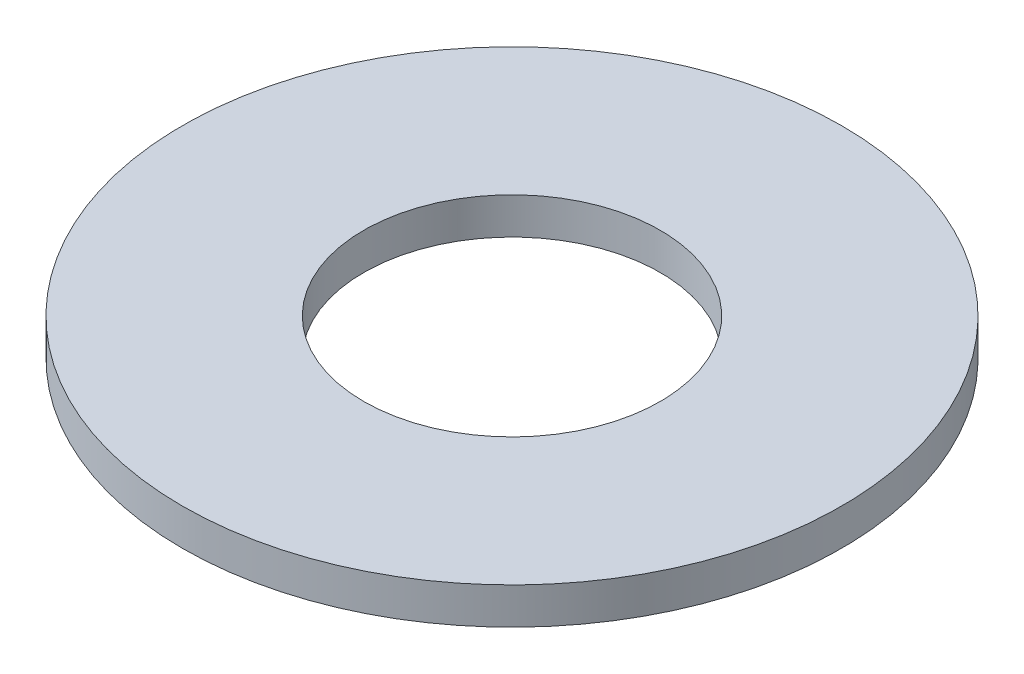
ISO-10303-21;
HEADER;
FILE_DESCRIPTION(('STEP AP214'),'2;1');
FILE_NAME('part.step','',(''),(''),'','','');
FILE_SCHEMA(('AUTOMOTIVE_DESIGN { 1 0 10303 214 1 1 1 1 }'));
ENDSEC;
DATA;
#1=APPLICATION_CONTEXT('core data for automotive mechanical design processes');
#2=APPLICATION_PROTOCOL_DEFINITION('international standard','automotive_design',2000,#1);
#3=PRODUCT_CONTEXT('',#1,'mechanical');
#4=PRODUCT('Part','Part','',(#3));
#5=PRODUCT_RELATED_PRODUCT_CATEGORY('part','',(#4));
#6=PRODUCT_DEFINITION_FORMATION('','',#4);
#7=PRODUCT_DEFINITION_CONTEXT('part definition',#1,'design');
#8=PRODUCT_DEFINITION('design','',#6,#7);
#9=PRODUCT_DEFINITION_SHAPE('','',#8);
#10=(LENGTH_UNIT() NAMED_UNIT(*) SI_UNIT(.MILLI.,.METRE.));
#11=(NAMED_UNIT(*) PLANE_ANGLE_UNIT() SI_UNIT($,.RADIAN.));
#12=(NAMED_UNIT(*) SI_UNIT($,.STERADIAN.) SOLID_ANGLE_UNIT());
#13=UNCERTAINTY_MEASURE_WITH_UNIT(LENGTH_MEASURE(1.E-05),#10,'distance_accuracy_value','');
#14=(GEOMETRIC_REPRESENTATION_CONTEXT(3) GLOBAL_UNCERTAINTY_ASSIGNED_CONTEXT((#13)) GLOBAL_UNIT_ASSIGNED_CONTEXT((#10,
#11,#12)) REPRESENTATION_CONTEXT('',''));
#15=CARTESIAN_POINT('',(0.,0.,0.));
#16=DIRECTION('',(0.,0.,1.));
#17=DIRECTION('',(1.,0.,0.));
#18=AXIS2_PLACEMENT_3D('',#15,#16,#17);
#19=CARTESIAN_POINT('',(0.,1.,0.));
#20=DIRECTION('',(0.,1.,0.));
#21=DIRECTION('',(0.,0.,1.));
#22=AXIS2_PLACEMENT_3D('',#19,#20,#21);
#23=PLANE('',#22);
#24=CARTESIAN_POINT('',(0.,1.,0.));
#25=DIRECTION('',(0.,1.,0.));
#26=DIRECTION('',(0.,0.,1.));
#27=AXIS2_PLACEMENT_3D('',#24,#25,#26);
#28=CIRCLE('',#27,9.);
#29=CARTESIAN_POINT('',(0.,1.,9.));
#30=VERTEX_POINT('',#29);
#31=EDGE_CURVE('E10',#30,#30,#28,.T.);
#32=ORIENTED_EDGE('',*,*,#31,.T.);
#33=EDGE_LOOP('',(#32));
#34=FACE_BOUND('',#33,.T.);
#35=CARTESIAN_POINT('',(0.,1.,0.));
#36=DIRECTION('',(0.,1.,0.));
#37=DIRECTION('',(0.,0.,1.));
#38=AXIS2_PLACEMENT_3D('',#35,#36,#37);
#39=CIRCLE('',#38,4.05);
#40=CARTESIAN_POINT('',(0.,1.,4.05));
#41=VERTEX_POINT('',#40);
#42=EDGE_CURVE('E56',#41,#41,#39,.T.);
#43=ORIENTED_EDGE('',*,*,#42,.F.);
#44=EDGE_LOOP('',(#43));
#45=FACE_BOUND('',#44,.T.);
#46=ADVANCED_FACE('F43',(#34,#45),#23,.T.);
#47=CARTESIAN_POINT('',(0.,0.,0.));
#48=DIRECTION('',(0.,1.,0.));
#49=DIRECTION('',(0.,0.,1.));
#50=AXIS2_PLACEMENT_3D('',#47,#48,#49);
#51=PLANE('',#50);
#52=CARTESIAN_POINT('',(0.,0.,0.));
#53=DIRECTION('',(0.,1.,0.));
#54=DIRECTION('',(0.,0.,1.));
#55=AXIS2_PLACEMENT_3D('',#52,#53,#54);
#56=CIRCLE('',#55,9.);
#57=CARTESIAN_POINT('',(0.,0.,9.));
#58=VERTEX_POINT('',#57);
#59=EDGE_CURVE('E47',#58,#58,#56,.T.);
#60=ORIENTED_EDGE('',*,*,#59,.F.);
#61=EDGE_LOOP('',(#60));
#62=FACE_BOUND('',#61,.T.);
#63=CARTESIAN_POINT('',(0.,0.,0.));
#64=DIRECTION('',(0.,1.,0.));
#65=DIRECTION('',(0.,0.,1.));
#66=AXIS2_PLACEMENT_3D('',#63,#64,#65);
#67=CIRCLE('',#66,4.05);
#68=CARTESIAN_POINT('',(0.,0.,4.05));
#69=VERTEX_POINT('',#68);
#70=EDGE_CURVE('E58',#69,#69,#67,.T.);
#71=ORIENTED_EDGE('',*,*,#70,.T.);
#72=EDGE_LOOP('',(#71));
#73=FACE_BOUND('',#72,.T.);
#74=ADVANCED_FACE('F70',(#62,#73),#51,.F.);
#75=CARTESIAN_POINT('',(0.,1.,0.));
#76=DIRECTION('',(0.,-1.,0.));
#77=DIRECTION('',(0.,0.,-1.));
#78=AXIS2_PLACEMENT_3D('',#75,#76,#77);
#79=CYLINDRICAL_SURFACE('',#78,9.);
#80=ORIENTED_EDGE('',*,*,#31,.F.);
#81=EDGE_LOOP('',(#80));
#82=FACE_BOUND('',#81,.T.);
#83=ORIENTED_EDGE('',*,*,#59,.T.);
#84=EDGE_LOOP('',(#83));
#85=FACE_BOUND('',#84,.T.);
#86=ADVANCED_FACE('F45',(#82,#85),#79,.T.);
#87=CARTESIAN_POINT('',(0.,1.,0.));
#88=DIRECTION('',(0.,-1.,0.));
#89=DIRECTION('',(0.,0.,-1.));
#90=AXIS2_PLACEMENT_3D('',#87,#88,#89);
#91=CYLINDRICAL_SURFACE('',#90,4.05);
#92=ORIENTED_EDGE('',*,*,#42,.T.);
#93=EDGE_LOOP('',(#92));
#94=FACE_BOUND('',#93,.T.);
#95=ORIENTED_EDGE('',*,*,#70,.F.);
#96=EDGE_LOOP('',(#95));
#97=FACE_BOUND('',#96,.T.);
#98=ADVANCED_FACE('F66',(#94,#97),#91,.F.);
#99=CLOSED_SHELL('',(#46,#74,#86,#98));
#100=MANIFOLD_SOLID_BREP('B2',#99);
#101=ADVANCED_BREP_SHAPE_REPRESENTATION('',(#18,#100),#14);
#102=SHAPE_DEFINITION_REPRESENTATION(#9,#101);
ENDSEC;
END-ISO-10303-21;
